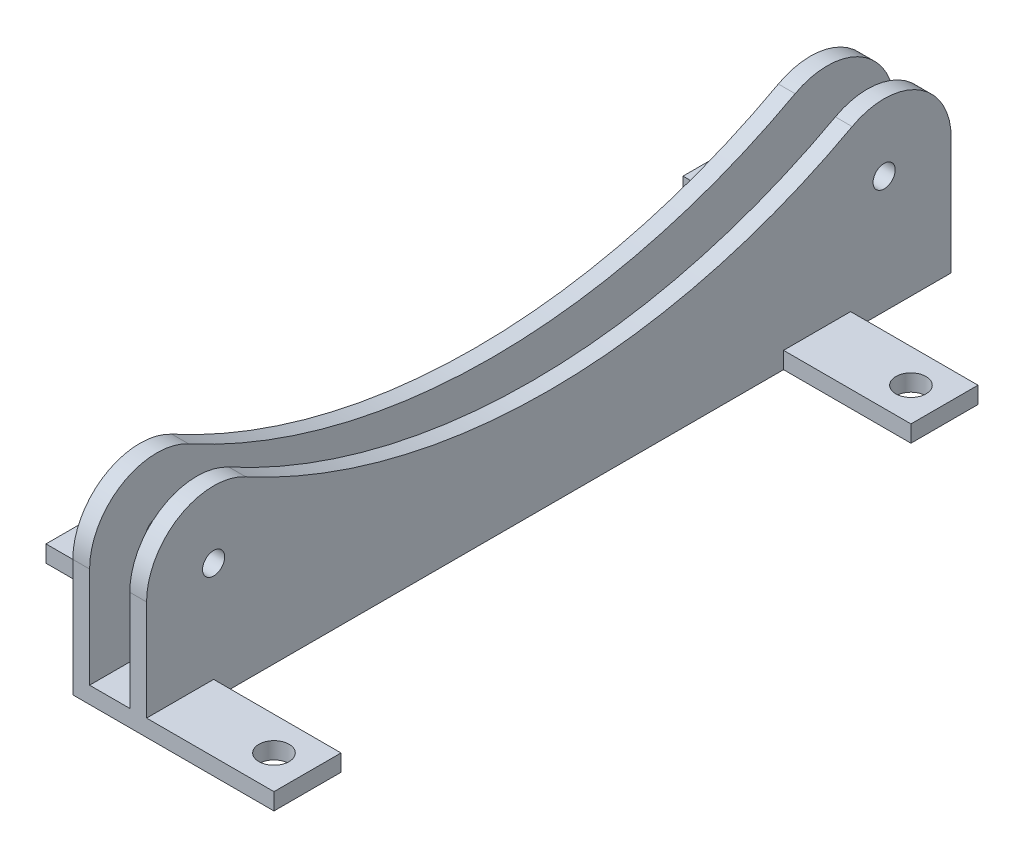
ISO-10303-21;
HEADER;
FILE_DESCRIPTION(('STEP AP214'),'2;1');
FILE_NAME('part.step','',(''),(''),'','','');
FILE_SCHEMA(('AUTOMOTIVE_DESIGN { 1 0 10303 214 1 1 1 1 }'));
ENDSEC;
DATA;
#1=APPLICATION_CONTEXT('core data for automotive mechanical design processes');
#2=APPLICATION_PROTOCOL_DEFINITION('international standard','automotive_design',2000,#1);
#3=PRODUCT_CONTEXT('',#1,'mechanical');
#4=PRODUCT('Part','Part','',(#3));
#5=PRODUCT_RELATED_PRODUCT_CATEGORY('part','',(#4));
#6=PRODUCT_DEFINITION_FORMATION('','',#4);
#7=PRODUCT_DEFINITION_CONTEXT('part definition',#1,'design');
#8=PRODUCT_DEFINITION('design','',#6,#7);
#9=PRODUCT_DEFINITION_SHAPE('','',#8);
#10=(LENGTH_UNIT() NAMED_UNIT(*) SI_UNIT(.MILLI.,.METRE.));
#11=(NAMED_UNIT(*) PLANE_ANGLE_UNIT() SI_UNIT($,.RADIAN.));
#12=(NAMED_UNIT(*) SI_UNIT($,.STERADIAN.) SOLID_ANGLE_UNIT());
#13=UNCERTAINTY_MEASURE_WITH_UNIT(LENGTH_MEASURE(1.E-05),#10,'distance_accuracy_value','');
#14=(GEOMETRIC_REPRESENTATION_CONTEXT(3) GLOBAL_UNCERTAINTY_ASSIGNED_CONTEXT((#13)) GLOBAL_UNIT_ASSIGNED_CONTEXT((#10,
#11,#12)) REPRESENTATION_CONTEXT('',''));
#15=CARTESIAN_POINT('',(0.,0.,0.));
#16=DIRECTION('',(0.,0.,1.));
#17=DIRECTION('',(1.,0.,0.));
#18=AXIS2_PLACEMENT_3D('',#15,#16,#17);
#19=CARTESIAN_POINT('',(0.,2.5,0.));
#20=DIRECTION('',(0.,-1.,0.));
#21=DIRECTION('',(0.,0.,-1.));
#22=AXIS2_PLACEMENT_3D('',#19,#20,#21);
#23=PLANE('',#22);
#24=DIRECTION('',(0.,0.,-1.));
#25=VECTOR('',#24,1.);
#26=CARTESIAN_POINT('',(2.5,2.5,0.));
#27=LINE('',#26,#25);
#28=CARTESIAN_POINT('',(2.5,2.5,-35.));
#29=VERTEX_POINT('',#28);
#30=CARTESIAN_POINT('',(2.5,2.5,-45.));
#31=VERTEX_POINT('',#30);
#32=EDGE_CURVE('E260',#29,#31,#27,.T.);
#33=ORIENTED_EDGE('',*,*,#32,.F.);
#34=DIRECTION('',(-1.,0.,0.));
#35=VECTOR('',#34,1.);
#36=CARTESIAN_POINT('',(-8.5,2.5,-35.));
#37=LINE('',#36,#35);
#38=CARTESIAN_POINT('',(21.5,2.5,-35.));
#39=VERTEX_POINT('',#38);
#40=EDGE_CURVE('E248',#39,#29,#37,.T.);
#41=ORIENTED_EDGE('',*,*,#40,.F.);
#42=DIRECTION('',(0.,0.,1.));
#43=VECTOR('',#42,1.);
#44=CARTESIAN_POINT('',(21.5,2.5,-35.));
#45=LINE('',#44,#43);
#46=CARTESIAN_POINT('',(21.5,2.5,-45.));
#47=VERTEX_POINT('',#46);
#48=EDGE_CURVE('E244',#47,#39,#45,.T.);
#49=ORIENTED_EDGE('',*,*,#48,.F.);
#50=DIRECTION('',(1.,0.,0.));
#51=VECTOR('',#50,1.);
#52=CARTESIAN_POINT('',(-8.5,2.5,-45.));
#53=LINE('',#52,#51);
#54=EDGE_CURVE('E242',#31,#47,#53,.T.);
#55=ORIENTED_EDGE('',*,*,#54,.F.);
#56=EDGE_LOOP('',(#33,#41,#49,#55));
#57=FACE_BOUND('',#56,.T.);
#58=CARTESIAN_POINT('',(16.5,2.5,-40.));
#59=DIRECTION('',(0.,1.,0.));
#60=DIRECTION('',(0.,0.,1.));
#61=AXIS2_PLACEMENT_3D('',#58,#59,#60);
#62=CIRCLE('',#61,2.25);
#63=CARTESIAN_POINT('',(16.5,2.5,-37.75));
#64=VERTEX_POINT('',#63);
#65=EDGE_CURVE('E899',#64,#64,#62,.T.);
#66=ORIENTED_EDGE('',*,*,#65,.F.);
#67=EDGE_LOOP('',(#66));
#68=FACE_BOUND('',#67,.T.);
#69=ADVANCED_FACE('F35',(#57,#68),#23,.F.);
#70=CARTESIAN_POINT('',(0.,0.,0.));
#71=DIRECTION('',(1.,0.,0.));
#72=DIRECTION('',(0.,0.,-1.));
#73=AXIS2_PLACEMENT_3D('',#70,#71,#72);
#74=PLANE('',#73);
#75=CARTESIAN_POINT('',(0.,17.5,-50.));
#76=DIRECTION('',(1.,0.,0.));
#77=DIRECTION('',(0.,0.,-1.));
#78=AXIS2_PLACEMENT_3D('',#75,#76,#77);
#79=CIRCLE('',#78,1.65);
#80=CARTESIAN_POINT('',(0.,17.5,-51.65));
#81=VERTEX_POINT('',#80);
#82=EDGE_CURVE('E315',#81,#81,#79,.T.);
#83=ORIENTED_EDGE('',*,*,#82,.T.);
#84=EDGE_LOOP('',(#83));
#85=FACE_BOUND('',#84,.T.);
#86=CARTESIAN_POINT('',(0.,17.5,50.));
#87=DIRECTION('',(1.,0.,0.));
#88=DIRECTION('',(0.,0.,-1.));
#89=AXIS2_PLACEMENT_3D('',#86,#87,#88);
#90=CIRCLE('',#89,1.65);
#91=CARTESIAN_POINT('',(0.,17.5,48.35));
#92=VERTEX_POINT('',#91);
#93=EDGE_CURVE('E325',#92,#92,#90,.T.);
#94=ORIENTED_EDGE('',*,*,#93,.T.);
#95=EDGE_LOOP('',(#94));
#96=FACE_BOUND('',#95,.T.);
#97=DIRECTION('',(0.,0.,-1.));
#98=VECTOR('',#97,1.);
#99=CARTESIAN_POINT('',(0.,2.5,-60.));
#100=LINE('',#99,#98);
#101=CARTESIAN_POINT('',(0.,2.5,60.));
#102=VERTEX_POINT('',#101);
#103=CARTESIAN_POINT('',(0.,2.5,-60.));
#104=VERTEX_POINT('',#103);
#105=EDGE_CURVE('E371',#102,#104,#100,.T.);
#106=ORIENTED_EDGE('',*,*,#105,.F.);
#107=DIRECTION('',(0.,1.,0.));
#108=VECTOR('',#107,1.);
#109=CARTESIAN_POINT('',(0.,0.,60.));
#110=LINE('',#109,#108);
#111=CARTESIAN_POINT('',(0.,17.5,60.));
#112=VERTEX_POINT('',#111);
#113=EDGE_CURVE('E400',#102,#112,#110,.T.);
#114=ORIENTED_EDGE('',*,*,#113,.T.);
#115=CARTESIAN_POINT('',(0.,17.5,50.));
#116=DIRECTION('',(1.,0.,0.));
#117=DIRECTION('',(0.,0.,-1.));
#118=AXIS2_PLACEMENT_3D('',#115,#116,#117);
#119=CIRCLE('',#118,10.);
#120=CARTESIAN_POINT('',(0.,26.2872576193619,45.2267303102625));
#121=VERTEX_POINT('',#120);
#122=EDGE_CURVE('E397',#121,#112,#119,.T.);
#123=ORIENTED_EDGE('',*,*,#122,.F.);
#124=CARTESIAN_POINT('',(0.,109.546523562816,0.));
#125=DIRECTION('',(1.,0.,0.));
#126=DIRECTION('',(0.,0.,-1.));
#127=AXIS2_PLACEMENT_3D('',#124,#125,#126);
#128=CIRCLE('',#127,94.75);
#129=CARTESIAN_POINT('',(0.,26.2872576193619,-45.2267303102625));
#130=VERTEX_POINT('',#129);
#131=EDGE_CURVE('E373',#121,#130,#128,.T.);
#132=ORIENTED_EDGE('',*,*,#131,.T.);
#133=CARTESIAN_POINT('',(0.,17.5,-50.));
#134=DIRECTION('',(1.,0.,0.));
#135=DIRECTION('',(0.,0.,-1.));
#136=AXIS2_PLACEMENT_3D('',#133,#134,#135);
#137=CIRCLE('',#136,10.);
#138=CARTESIAN_POINT('',(0.,17.5,-60.));
#139=VERTEX_POINT('',#138);
#140=EDGE_CURVE('E383',#139,#130,#137,.T.);
#141=ORIENTED_EDGE('',*,*,#140,.F.);
#142=DIRECTION('',(0.,-1.,0.));
#143=VECTOR('',#142,1.);
#144=CARTESIAN_POINT('',(0.,0.,-60.));
#145=LINE('',#144,#143);
#146=EDGE_CURVE('E402',#139,#104,#145,.T.);
#147=ORIENTED_EDGE('',*,*,#146,.T.);
#148=EDGE_LOOP('',(#106,#114,#123,#132,#141,#147));
#149=FACE_BOUND('',#148,.T.);
#150=ADVANCED_FACE('F463',(#85,#96,#149),#74,.F.);
#151=CARTESIAN_POINT('',(2.5,109.546523562816,0.));
#152=DIRECTION('',(-1.,0.,0.));
#153=DIRECTION('',(0.,0.,1.));
#154=AXIS2_PLACEMENT_3D('',#151,#152,#153);
#155=CYLINDRICAL_SURFACE('',#154,94.75);
#156=ORIENTED_EDGE('',*,*,#131,.F.);
#157=DIRECTION('',(-1.,0.,0.));
#158=VECTOR('',#157,1.);
#159=CARTESIAN_POINT('',(2.5,26.2872576193619,45.2267303102625));
#160=LINE('',#159,#158);
#161=CARTESIAN_POINT('',(2.5,26.2872576193619,45.2267303102625));
#162=VERTEX_POINT('',#161);
#163=EDGE_CURVE('E417',#162,#121,#160,.T.);
#164=ORIENTED_EDGE('',*,*,#163,.F.);
#165=CARTESIAN_POINT('',(2.5,109.546523562816,0.));
#166=DIRECTION('',(1.,0.,0.));
#167=DIRECTION('',(0.,0.,-1.));
#168=AXIS2_PLACEMENT_3D('',#165,#166,#167);
#169=CIRCLE('',#168,94.75);
#170=CARTESIAN_POINT('',(2.5,26.2872576193619,-45.2267303102625));
#171=VERTEX_POINT('',#170);
#172=EDGE_CURVE('E379',#162,#171,#169,.T.);
#173=ORIENTED_EDGE('',*,*,#172,.T.);
#174=DIRECTION('',(-1.,0.,0.));
#175=VECTOR('',#174,1.);
#176=CARTESIAN_POINT('',(2.5,26.2872576193619,-45.2267303102625));
#177=LINE('',#176,#175);
#178=EDGE_CURVE('E394',#171,#130,#177,.T.);
#179=ORIENTED_EDGE('',*,*,#178,.T.);
#180=EDGE_LOOP('',(#156,#164,#173,#179));
#181=FACE_BOUND('',#180,.T.);
#182=ADVANCED_FACE('F37',(#181),#155,.F.);
#183=CARTESIAN_POINT('',(2.5,17.5,50.));
#184=DIRECTION('',(-1.,0.,0.));
#185=DIRECTION('',(0.,0.,1.));
#186=AXIS2_PLACEMENT_3D('',#183,#184,#185);
#187=CYLINDRICAL_SURFACE('',#186,10.);
#188=ORIENTED_EDGE('',*,*,#122,.T.);
#189=DIRECTION('',(-1.,0.,0.));
#190=VECTOR('',#189,1.);
#191=CARTESIAN_POINT('',(2.5,17.5,60.));
#192=LINE('',#191,#190);
#193=CARTESIAN_POINT('',(2.5,17.5,60.));
#194=VERTEX_POINT('',#193);
#195=EDGE_CURVE('E414',#194,#112,#192,.T.);
#196=ORIENTED_EDGE('',*,*,#195,.F.);
#197=CARTESIAN_POINT('',(2.5,17.5,50.));
#198=DIRECTION('',(1.,0.,0.));
#199=DIRECTION('',(0.,0.,-1.));
#200=AXIS2_PLACEMENT_3D('',#197,#198,#199);
#201=CIRCLE('',#200,10.);
#202=EDGE_CURVE('E382',#162,#194,#201,.T.);
#203=ORIENTED_EDGE('',*,*,#202,.F.);
#204=ORIENTED_EDGE('',*,*,#163,.T.);
#205=EDGE_LOOP('',(#188,#196,#203,#204));
#206=FACE_BOUND('',#205,.T.);
#207=ADVANCED_FACE('F809',(#206),#187,.T.);
#208=CARTESIAN_POINT('',(2.5,0.,60.));
#209=DIRECTION('',(0.,0.,1.));
#210=DIRECTION('',(1.,0.,0.));
#211=AXIS2_PLACEMENT_3D('',#208,#209,#210);
#212=PLANE('',#211);
#213=DIRECTION('',(1.,0.,0.));
#214=VECTOR('',#213,1.);
#215=CARTESIAN_POINT('',(-500000.,2.5,60.));
#216=LINE('',#215,#214);
#217=CARTESIAN_POINT('',(-6.00000000008549,2.5,60.));
#218=VERTEX_POINT('',#217);
#219=EDGE_CURVE('E370',#218,#102,#216,.T.);
#220=ORIENTED_EDGE('',*,*,#219,.F.);
#221=DIRECTION('',(0.,1.,0.));
#222=VECTOR('',#221,1.);
#223=CARTESIAN_POINT('',(-6.,0.,60.));
#224=LINE('',#223,#222);
#225=CARTESIAN_POINT('',(-6.,17.5,60.));
#226=VERTEX_POINT('',#225);
#227=EDGE_CURVE('E353',#218,#226,#224,.T.);
#228=ORIENTED_EDGE('',*,*,#227,.T.);
#229=DIRECTION('',(1.,0.,0.));
#230=VECTOR('',#229,1.);
#231=CARTESIAN_POINT('',(-8.5,17.5,60.));
#232=LINE('',#231,#230);
#233=CARTESIAN_POINT('',(-8.5,17.5,60.));
#234=VERTEX_POINT('',#233);
#235=EDGE_CURVE('E365',#234,#226,#232,.T.);
#236=ORIENTED_EDGE('',*,*,#235,.F.);
#237=DIRECTION('',(0.,1.,0.));
#238=VECTOR('',#237,1.);
#239=CARTESIAN_POINT('',(-8.5,0.,60.));
#240=LINE('',#239,#238);
#241=CARTESIAN_POINT('',(-8.5,0.,60.));
#242=VERTEX_POINT('',#241);
#243=EDGE_CURVE('E336',#242,#234,#240,.T.);
#244=ORIENTED_EDGE('',*,*,#243,.F.);
#245=DIRECTION('',(-1.,0.,0.));
#246=VECTOR('',#245,1.);
#247=CARTESIAN_POINT('',(2.5,0.,60.));
#248=LINE('',#247,#246);
#249=CARTESIAN_POINT('',(21.5,0.,60.));
#250=VERTEX_POINT('',#249);
#251=EDGE_CURVE('E412',#250,#242,#248,.T.);
#252=ORIENTED_EDGE('',*,*,#251,.F.);
#253=DIRECTION('',(0.,-1.,0.));
#254=VECTOR('',#253,1.);
#255=CARTESIAN_POINT('',(21.5,2.5,60.));
#256=LINE('',#255,#254);
#257=CARTESIAN_POINT('',(21.5,2.5,60.));
#258=VERTEX_POINT('',#257);
#259=EDGE_CURVE('E225',#258,#250,#256,.T.);
#260=ORIENTED_EDGE('',*,*,#259,.F.);
#261=DIRECTION('',(-1.,0.,0.));
#262=VECTOR('',#261,1.);
#263=CARTESIAN_POINT('',(-8.5,2.5,60.));
#264=LINE('',#263,#262);
#265=CARTESIAN_POINT('',(2.5,2.5,60.));
#266=VERTEX_POINT('',#265);
#267=EDGE_CURVE('E226',#258,#266,#264,.T.);
#268=ORIENTED_EDGE('',*,*,#267,.T.);
#269=DIRECTION('',(0.,1.,0.));
#270=VECTOR('',#269,1.);
#271=CARTESIAN_POINT('',(2.5,0.,60.));
#272=LINE('',#271,#270);
#273=EDGE_CURVE('E55',#266,#194,#272,.T.);
#274=ORIENTED_EDGE('',*,*,#273,.T.);
#275=ORIENTED_EDGE('',*,*,#195,.T.);
#276=ORIENTED_EDGE('',*,*,#113,.F.);
#277=EDGE_LOOP('',(#220,#228,#236,#244,#252,#260,#268,#274,#275,#276));
#278=FACE_BOUND('',#277,.T.);
#279=ADVANCED_FACE('F504',(#278),#212,.T.);
#280=CARTESIAN_POINT('',(2.5,0.,0.));
#281=DIRECTION('',(0.,1.,0.));
#282=DIRECTION('',(0.,0.,1.));
#283=AXIS2_PLACEMENT_3D('',#280,#281,#282);
#284=PLANE('',#283);
#285=CARTESIAN_POINT('',(-22.5,0.,-55.));
#286=DIRECTION('',(0.,1.,0.));
#287=DIRECTION('',(0.,0.,1.));
#288=AXIS2_PLACEMENT_3D('',#285,#286,#287);
#289=CIRCLE('',#288,2.25);
#290=CARTESIAN_POINT('',(-22.5,0.,-52.75));
#291=VERTEX_POINT('',#290);
#292=EDGE_CURVE('E879',#291,#291,#289,.T.);
#293=ORIENTED_EDGE('',*,*,#292,.T.);
#294=EDGE_LOOP('',(#293));
#295=FACE_BOUND('',#294,.T.);
#296=CARTESIAN_POINT('',(16.5,0.,-40.));
#297=DIRECTION('',(0.,1.,0.));
#298=DIRECTION('',(0.,0.,1.));
#299=AXIS2_PLACEMENT_3D('',#296,#297,#298);
#300=CIRCLE('',#299,2.25);
#301=CARTESIAN_POINT('',(16.5,0.,-37.75));
#302=VERTEX_POINT('',#301);
#303=EDGE_CURVE('E883',#302,#302,#300,.T.);
#304=ORIENTED_EDGE('',*,*,#303,.T.);
#305=EDGE_LOOP('',(#304));
#306=FACE_BOUND('',#305,.T.);
#307=CARTESIAN_POINT('',(16.5,0.,55.));
#308=DIRECTION('',(0.,1.,0.));
#309=DIRECTION('',(0.,0.,1.));
#310=AXIS2_PLACEMENT_3D('',#307,#308,#309);
#311=CIRCLE('',#310,2.25);
#312=CARTESIAN_POINT('',(16.5,0.,57.25));
#313=VERTEX_POINT('',#312);
#314=EDGE_CURVE('E887',#313,#313,#311,.T.);
#315=ORIENTED_EDGE('',*,*,#314,.T.);
#316=EDGE_LOOP('',(#315));
#317=FACE_BOUND('',#316,.T.);
#318=CARTESIAN_POINT('',(-22.5,0.,40.));
#319=DIRECTION('',(0.,1.,0.));
#320=DIRECTION('',(0.,0.,1.));
#321=AXIS2_PLACEMENT_3D('',#318,#319,#320);
#322=CIRCLE('',#321,2.25);
#323=CARTESIAN_POINT('',(-22.5,0.,42.25));
#324=VERTEX_POINT('',#323);
#325=EDGE_CURVE('E236',#324,#324,#322,.T.);
#326=ORIENTED_EDGE('',*,*,#325,.T.);
#327=EDGE_LOOP('',(#326));
#328=FACE_BOUND('',#327,.T.);
#329=DIRECTION('',(0.,0.,-1.));
#330=VECTOR('',#329,1.);
#331=CARTESIAN_POINT('',(2.5,0.,0.));
#332=LINE('',#331,#330);
#333=CARTESIAN_POINT('',(2.5,0.,50.));
#334=VERTEX_POINT('',#333);
#335=CARTESIAN_POINT('',(2.5,0.,-35.));
#336=VERTEX_POINT('',#335);
#337=EDGE_CURVE('E387',#334,#336,#332,.T.);
#338=ORIENTED_EDGE('',*,*,#337,.F.);
#339=DIRECTION('',(1.,0.,0.));
#340=VECTOR('',#339,1.);
#341=CARTESIAN_POINT('',(-8.5,0.,50.));
#342=LINE('',#341,#340);
#343=CARTESIAN_POINT('',(21.5,0.,50.));
#344=VERTEX_POINT('',#343);
#345=EDGE_CURVE('E234',#334,#344,#342,.T.);
#346=ORIENTED_EDGE('',*,*,#345,.T.);
#347=DIRECTION('',(0.,0.,1.));
#348=VECTOR('',#347,1.);
#349=CARTESIAN_POINT('',(21.5,0.,60.));
#350=LINE('',#349,#348);
#351=EDGE_CURVE('E217',#344,#250,#350,.T.);
#352=ORIENTED_EDGE('',*,*,#351,.T.);
#353=ORIENTED_EDGE('',*,*,#251,.T.);
#354=DIRECTION('',(0.,0.,-1.));
#355=VECTOR('',#354,1.);
#356=CARTESIAN_POINT('',(-8.5,0.,0.));
#357=LINE('',#356,#355);
#358=CARTESIAN_POINT('',(-8.5,0.,45.));
#359=VERTEX_POINT('',#358);
#360=EDGE_CURVE('E339',#242,#359,#357,.T.);
#361=ORIENTED_EDGE('',*,*,#360,.T.);
#362=DIRECTION('',(-1.,0.,0.));
#363=VECTOR('',#362,1.);
#364=CARTESIAN_POINT('',(2.5,0.,45.));
#365=LINE('',#364,#363);
#366=CARTESIAN_POINT('',(-27.5,0.,45.));
#367=VERTEX_POINT('',#366);
#368=EDGE_CURVE('E287',#359,#367,#365,.T.);
#369=ORIENTED_EDGE('',*,*,#368,.T.);
#370=DIRECTION('',(0.,0.,-1.));
#371=VECTOR('',#370,1.);
#372=CARTESIAN_POINT('',(-27.5,0.,45.));
#373=LINE('',#372,#371);
#374=CARTESIAN_POINT('',(-27.5,0.,35.));
#375=VERTEX_POINT('',#374);
#376=EDGE_CURVE('E301',#367,#375,#373,.T.);
#377=ORIENTED_EDGE('',*,*,#376,.T.);
#378=DIRECTION('',(1.,0.,0.));
#379=VECTOR('',#378,1.);
#380=CARTESIAN_POINT('',(2.5,0.,35.));
#381=LINE('',#380,#379);
#382=CARTESIAN_POINT('',(-8.5,0.,35.));
#383=VERTEX_POINT('',#382);
#384=EDGE_CURVE('E293',#375,#383,#381,.T.);
#385=ORIENTED_EDGE('',*,*,#384,.T.);
#386=CARTESIAN_POINT('',(-8.5,0.,-50.));
#387=VERTEX_POINT('',#386);
#388=EDGE_CURVE('E338',#383,#387,#357,.T.);
#389=ORIENTED_EDGE('',*,*,#388,.T.);
#390=DIRECTION('',(-1.,0.,0.));
#391=VECTOR('',#390,1.);
#392=CARTESIAN_POINT('',(2.49999999999999,0.,-50.));
#393=LINE('',#392,#391);
#394=CARTESIAN_POINT('',(-27.5,0.,-50.));
#395=VERTEX_POINT('',#394);
#396=EDGE_CURVE('E270',#387,#395,#393,.T.);
#397=ORIENTED_EDGE('',*,*,#396,.T.);
#398=DIRECTION('',(0.,0.,-1.));
#399=VECTOR('',#398,1.);
#400=CARTESIAN_POINT('',(-27.5,0.,-60.));
#401=LINE('',#400,#399);
#402=CARTESIAN_POINT('',(-27.5,0.,-60.));
#403=VERTEX_POINT('',#402);
#404=EDGE_CURVE('E274',#395,#403,#401,.T.);
#405=ORIENTED_EDGE('',*,*,#404,.T.);
#406=DIRECTION('',(-1.,0.,0.));
#407=VECTOR('',#406,1.);
#408=CARTESIAN_POINT('',(2.5,0.,-60.));
#409=LINE('',#408,#407);
#410=CARTESIAN_POINT('',(2.5,0.,-60.));
#411=VERTEX_POINT('',#410);
#412=EDGE_CURVE('E410',#411,#403,#409,.T.);
#413=ORIENTED_EDGE('',*,*,#412,.F.);
#414=CARTESIAN_POINT('',(2.5,0.,-45.));
#415=VERTEX_POINT('',#414);
#416=EDGE_CURVE('E386',#415,#411,#332,.T.);
#417=ORIENTED_EDGE('',*,*,#416,.F.);
#418=DIRECTION('',(1.,0.,0.));
#419=VECTOR('',#418,1.);
#420=CARTESIAN_POINT('',(-8.5,0.,-45.));
#421=LINE('',#420,#419);
#422=CARTESIAN_POINT('',(21.5,0.,-45.));
#423=VERTEX_POINT('',#422);
#424=EDGE_CURVE('E241',#415,#423,#421,.T.);
#425=ORIENTED_EDGE('',*,*,#424,.T.);
#426=DIRECTION('',(0.,0.,1.));
#427=VECTOR('',#426,1.);
#428=CARTESIAN_POINT('',(21.5,0.,-35.));
#429=LINE('',#428,#427);
#430=CARTESIAN_POINT('',(21.5,0.,-35.));
#431=VERTEX_POINT('',#430);
#432=EDGE_CURVE('E253',#423,#431,#429,.T.);
#433=ORIENTED_EDGE('',*,*,#432,.T.);
#434=DIRECTION('',(-1.,0.,0.));
#435=VECTOR('',#434,1.);
#436=CARTESIAN_POINT('',(-8.5,0.,-35.));
#437=LINE('',#436,#435);
#438=EDGE_CURVE('E245',#431,#336,#437,.T.);
#439=ORIENTED_EDGE('',*,*,#438,.T.);
#440=EDGE_LOOP('',(#338,#346,#352,#353,#361,#369,#377,#385,#389,#397,#405,#413,#417,#425,#433,#439));
#441=FACE_BOUND('',#440,.T.);
#442=ADVANCED_FACE('F477',(#295,#306,#317,#328,#441),#284,.F.);
#443=CARTESIAN_POINT('',(2.5,0.,-60.));
#444=DIRECTION('',(0.,0.,-1.));
#445=DIRECTION('',(-1.,0.,0.));
#446=AXIS2_PLACEMENT_3D('',#443,#444,#445);
#447=PLANE('',#446);
#448=DIRECTION('',(1.,0.,0.));
#449=VECTOR('',#448,1.);
#450=CARTESIAN_POINT('',(-500000.,2.5,-60.));
#451=LINE('',#450,#449);
#452=CARTESIAN_POINT('',(-6.,2.5,-60.));
#453=VERTEX_POINT('',#452);
#454=EDGE_CURVE('E374',#453,#104,#451,.T.);
#455=ORIENTED_EDGE('',*,*,#454,.T.);
#456=ORIENTED_EDGE('',*,*,#146,.F.);
#457=DIRECTION('',(-1.,0.,0.));
#458=VECTOR('',#457,1.);
#459=CARTESIAN_POINT('',(2.5,17.5,-60.));
#460=LINE('',#459,#458);
#461=CARTESIAN_POINT('',(2.5,17.5,-60.));
#462=VERTEX_POINT('',#461);
#463=EDGE_CURVE('E408',#462,#139,#460,.T.);
#464=ORIENTED_EDGE('',*,*,#463,.F.);
#465=DIRECTION('',(0.,-1.,0.));
#466=VECTOR('',#465,1.);
#467=CARTESIAN_POINT('',(2.5,0.,-60.));
#468=LINE('',#467,#466);
#469=EDGE_CURVE('E389',#462,#411,#468,.T.);
#470=ORIENTED_EDGE('',*,*,#469,.T.);
#471=ORIENTED_EDGE('',*,*,#412,.T.);
#472=DIRECTION('',(0.,-1.,0.));
#473=VECTOR('',#472,1.);
#474=CARTESIAN_POINT('',(-27.5,2.5,-60.));
#475=LINE('',#474,#473);
#476=CARTESIAN_POINT('',(-27.5,2.5,-60.));
#477=VERTEX_POINT('',#476);
#478=EDGE_CURVE('E284',#477,#403,#475,.T.);
#479=ORIENTED_EDGE('',*,*,#478,.F.);
#480=DIRECTION('',(1.,0.,0.));
#481=VECTOR('',#480,1.);
#482=CARTESIAN_POINT('',(2.5,2.5,-60.));
#483=LINE('',#482,#481);
#484=CARTESIAN_POINT('',(-8.5,2.5,-60.));
#485=VERTEX_POINT('',#484);
#486=EDGE_CURVE('E277',#477,#485,#483,.T.);
#487=ORIENTED_EDGE('',*,*,#486,.T.);
#488=DIRECTION('',(0.,-1.,0.));
#489=VECTOR('',#488,1.);
#490=CARTESIAN_POINT('',(-8.5,0.,-60.));
#491=LINE('',#490,#489);
#492=CARTESIAN_POINT('',(-8.5,17.5,-60.));
#493=VERTEX_POINT('',#492);
#494=EDGE_CURVE('E341',#493,#485,#491,.T.);
#495=ORIENTED_EDGE('',*,*,#494,.F.);
#496=DIRECTION('',(1.,0.,0.));
#497=VECTOR('',#496,1.);
#498=CARTESIAN_POINT('',(-8.5,17.5,-60.));
#499=LINE('',#498,#497);
#500=CARTESIAN_POINT('',(-6.,17.5,-60.));
#501=VERTEX_POINT('',#500);
#502=EDGE_CURVE('E363',#493,#501,#499,.T.);
#503=ORIENTED_EDGE('',*,*,#502,.T.);
#504=DIRECTION('',(0.,-1.,0.));
#505=VECTOR('',#504,1.);
#506=CARTESIAN_POINT('',(-6.,0.,-60.));
#507=LINE('',#506,#505);
#508=EDGE_CURVE('E355',#501,#453,#507,.T.);
#509=ORIENTED_EDGE('',*,*,#508,.T.);
#510=EDGE_LOOP('',(#455,#456,#464,#470,#471,#479,#487,#495,#503,#509));
#511=FACE_BOUND('',#510,.T.);
#512=ADVANCED_FACE('F440',(#511),#447,.T.);
#513=CARTESIAN_POINT('',(2.5,17.5,-50.));
#514=DIRECTION('',(-1.,0.,0.));
#515=DIRECTION('',(0.,0.,1.));
#516=AXIS2_PLACEMENT_3D('',#513,#514,#515);
#517=CYLINDRICAL_SURFACE('',#516,10.);
#518=ORIENTED_EDGE('',*,*,#140,.T.);
#519=ORIENTED_EDGE('',*,*,#178,.F.);
#520=CARTESIAN_POINT('',(2.5,17.5,-50.));
#521=DIRECTION('',(1.,0.,0.));
#522=DIRECTION('',(0.,0.,-1.));
#523=AXIS2_PLACEMENT_3D('',#520,#521,#522);
#524=CIRCLE('',#523,10.);
#525=EDGE_CURVE('E392',#462,#171,#524,.T.);
#526=ORIENTED_EDGE('',*,*,#525,.F.);
#527=ORIENTED_EDGE('',*,*,#463,.T.);
#528=EDGE_LOOP('',(#518,#519,#526,#527));
#529=FACE_BOUND('',#528,.T.);
#530=ADVANCED_FACE('F469',(#529),#517,.T.);
#531=CARTESIAN_POINT('',(2.5,0.,0.));
#532=DIRECTION('',(1.,0.,0.));
#533=DIRECTION('',(0.,0.,-1.));
#534=AXIS2_PLACEMENT_3D('',#531,#532,#533);
#535=PLANE('',#534);
#536=DIRECTION('',(0.,1.,0.));
#537=VECTOR('',#536,1.);
#538=CARTESIAN_POINT('',(2.5,0.,50.));
#539=LINE('',#538,#537);
#540=CARTESIAN_POINT('',(2.5,2.5,50.));
#541=VERTEX_POINT('',#540);
#542=EDGE_CURVE('E213',#334,#541,#539,.T.);
#543=ORIENTED_EDGE('',*,*,#542,.F.);
#544=ORIENTED_EDGE('',*,*,#337,.T.);
#545=DIRECTION('',(0.,-1.,0.));
#546=VECTOR('',#545,1.);
#547=CARTESIAN_POINT('',(2.5,0.,-35.));
#548=LINE('',#547,#546);
#549=EDGE_CURVE('E267',#29,#336,#548,.T.);
#550=ORIENTED_EDGE('',*,*,#549,.F.);
#551=ORIENTED_EDGE('',*,*,#32,.T.);
#552=DIRECTION('',(0.,1.,0.));
#553=VECTOR('',#552,1.);
#554=CARTESIAN_POINT('',(2.5,0.,-45.));
#555=LINE('',#554,#553);
#556=EDGE_CURVE('E264',#415,#31,#555,.T.);
#557=ORIENTED_EDGE('',*,*,#556,.F.);
#558=ORIENTED_EDGE('',*,*,#416,.T.);
#559=ORIENTED_EDGE('',*,*,#469,.F.);
#560=ORIENTED_EDGE('',*,*,#525,.T.);
#561=ORIENTED_EDGE('',*,*,#172,.F.);
#562=ORIENTED_EDGE('',*,*,#202,.T.);
#563=ORIENTED_EDGE('',*,*,#273,.F.);
#564=DIRECTION('',(0.,0.,-1.));
#565=VECTOR('',#564,1.);
#566=CARTESIAN_POINT('',(2.5,2.5,0.));
#567=LINE('',#566,#565);
#568=EDGE_CURVE('E50',#266,#541,#567,.T.);
#569=ORIENTED_EDGE('',*,*,#568,.T.);
#570=EDGE_LOOP('',(#543,#544,#550,#551,#557,#558,#559,#560,#561,#562,#563,#569));
#571=FACE_BOUND('',#570,.T.);
#572=CARTESIAN_POINT('',(2.5,17.5,-50.));
#573=DIRECTION('',(1.,0.,0.));
#574=DIRECTION('',(0.,0.,-1.));
#575=AXIS2_PLACEMENT_3D('',#572,#573,#574);
#576=CIRCLE('',#575,1.65);
#577=CARTESIAN_POINT('',(2.5,17.5,-51.65));
#578=VERTEX_POINT('',#577);
#579=EDGE_CURVE('E307',#578,#578,#576,.T.);
#580=ORIENTED_EDGE('',*,*,#579,.F.);
#581=EDGE_LOOP('',(#580));
#582=FACE_BOUND('',#581,.T.);
#583=CARTESIAN_POINT('',(2.5,17.5,50.));
#584=DIRECTION('',(1.,0.,0.));
#585=DIRECTION('',(0.,0.,-1.));
#586=AXIS2_PLACEMENT_3D('',#583,#584,#585);
#587=CIRCLE('',#586,1.65);
#588=CARTESIAN_POINT('',(2.5,17.5,48.35));
#589=VERTEX_POINT('',#588);
#590=EDGE_CURVE('E319',#589,#589,#587,.T.);
#591=ORIENTED_EDGE('',*,*,#590,.F.);
#592=EDGE_LOOP('',(#591));
#593=FACE_BOUND('',#592,.T.);
#594=ADVANCED_FACE('F472',(#571,#582,#593),#535,.T.);
#595=CARTESIAN_POINT('',(-500000.,2.5,-60.));
#596=DIRECTION('',(0.,-1.,0.));
#597=DIRECTION('',(0.,0.,-1.));
#598=AXIS2_PLACEMENT_3D('',#595,#596,#597);
#599=PLANE('',#598);
#600=DIRECTION('',(0.,0.,1.));
#601=VECTOR('',#600,1.);
#602=CARTESIAN_POINT('',(-5.99999999997181,2.5,-60.));
#603=LINE('',#602,#601);
#604=EDGE_CURVE('E362',#453,#218,#603,.T.);
#605=ORIENTED_EDGE('',*,*,#604,.T.);
#606=ORIENTED_EDGE('',*,*,#219,.T.);
#607=ORIENTED_EDGE('',*,*,#105,.T.);
#608=ORIENTED_EDGE('',*,*,#454,.F.);
#609=EDGE_LOOP('',(#605,#606,#607,#608));
#610=FACE_BOUND('',#609,.T.);
#611=ADVANCED_FACE('F458',(#610),#599,.F.);
#612=CARTESIAN_POINT('',(-6.,0.,0.));
#613=DIRECTION('',(1.,0.,0.));
#614=DIRECTION('',(0.,0.,-1.));
#615=AXIS2_PLACEMENT_3D('',#612,#613,#614);
#616=PLANE('',#615);
#617=CARTESIAN_POINT('',(-6.,17.5,-50.));
#618=DIRECTION('',(1.,0.,0.));
#619=DIRECTION('',(0.,0.,-1.));
#620=AXIS2_PLACEMENT_3D('',#617,#618,#619);
#621=CIRCLE('',#620,1.65);
#622=CARTESIAN_POINT('',(-6.,17.5,-51.65));
#623=VERTEX_POINT('',#622);
#624=EDGE_CURVE('E316',#623,#623,#621,.T.);
#625=ORIENTED_EDGE('',*,*,#624,.F.);
#626=EDGE_LOOP('',(#625));
#627=FACE_BOUND('',#626,.T.);
#628=CARTESIAN_POINT('',(-6.,17.5,50.));
#629=DIRECTION('',(1.,0.,0.));
#630=DIRECTION('',(0.,0.,-1.));
#631=AXIS2_PLACEMENT_3D('',#628,#629,#630);
#632=CIRCLE('',#631,1.65);
#633=CARTESIAN_POINT('',(-6.,17.5,48.35));
#634=VERTEX_POINT('',#633);
#635=EDGE_CURVE('E326',#634,#634,#632,.T.);
#636=ORIENTED_EDGE('',*,*,#635,.F.);
#637=EDGE_LOOP('',(#636));
#638=FACE_BOUND('',#637,.T.);
#639=ORIENTED_EDGE('',*,*,#604,.F.);
#640=ORIENTED_EDGE('',*,*,#508,.F.);
#641=CARTESIAN_POINT('',(-6.,17.5,-50.));
#642=DIRECTION('',(1.,0.,0.));
#643=DIRECTION('',(0.,0.,-1.));
#644=AXIS2_PLACEMENT_3D('',#641,#642,#643);
#645=CIRCLE('',#644,10.);
#646=CARTESIAN_POINT('',(-6.,26.2872576193619,-45.2267303102625));
#647=VERTEX_POINT('',#646);
#648=EDGE_CURVE('E333',#501,#647,#645,.T.);
#649=ORIENTED_EDGE('',*,*,#648,.T.);
#650=CARTESIAN_POINT('',(-6.,109.546523562816,0.));
#651=DIRECTION('',(1.,0.,0.));
#652=DIRECTION('',(0.,0.,-1.));
#653=AXIS2_PLACEMENT_3D('',#650,#651,#652);
#654=CIRCLE('',#653,94.75);
#655=CARTESIAN_POINT('',(-6.,26.2872576193619,45.2267303102625));
#656=VERTEX_POINT('',#655);
#657=EDGE_CURVE('E329',#656,#647,#654,.T.);
#658=ORIENTED_EDGE('',*,*,#657,.F.);
#659=CARTESIAN_POINT('',(-6.,17.5,50.));
#660=DIRECTION('',(1.,0.,0.));
#661=DIRECTION('',(0.,0.,-1.));
#662=AXIS2_PLACEMENT_3D('',#659,#660,#661);
#663=CIRCLE('',#662,10.);
#664=EDGE_CURVE('E350',#656,#226,#663,.T.);
#665=ORIENTED_EDGE('',*,*,#664,.T.);
#666=ORIENTED_EDGE('',*,*,#227,.F.);
#667=EDGE_LOOP('',(#639,#640,#649,#658,#665,#666));
#668=FACE_BOUND('',#667,.T.);
#669=ADVANCED_FACE('F453',(#627,#638,#668),#616,.T.);
#670=CARTESIAN_POINT('',(-8.5,109.546523562816,0.));
#671=DIRECTION('',(1.,0.,0.));
#672=DIRECTION('',(0.,0.,-1.));
#673=AXIS2_PLACEMENT_3D('',#670,#671,#672);
#674=CYLINDRICAL_SURFACE('',#673,94.75);
#675=ORIENTED_EDGE('',*,*,#657,.T.);
#676=DIRECTION('',(1.,0.,0.));
#677=VECTOR('',#676,1.);
#678=CARTESIAN_POINT('',(-8.5,26.2872576193619,-45.2267303102625));
#679=LINE('',#678,#677);
#680=CARTESIAN_POINT('',(-8.5,26.2872576193619,-45.2267303102625));
#681=VERTEX_POINT('',#680);
#682=EDGE_CURVE('E360',#681,#647,#679,.T.);
#683=ORIENTED_EDGE('',*,*,#682,.F.);
#684=CARTESIAN_POINT('',(-8.5,109.546523562816,0.));
#685=DIRECTION('',(1.,0.,0.));
#686=DIRECTION('',(0.,0.,-1.));
#687=AXIS2_PLACEMENT_3D('',#684,#685,#686);
#688=CIRCLE('',#687,94.75);
#689=CARTESIAN_POINT('',(-8.5,26.2872576193619,45.2267303102625));
#690=VERTEX_POINT('',#689);
#691=EDGE_CURVE('E330',#690,#681,#688,.T.);
#692=ORIENTED_EDGE('',*,*,#691,.F.);
#693=DIRECTION('',(1.,0.,0.));
#694=VECTOR('',#693,1.);
#695=CARTESIAN_POINT('',(-8.5,26.2872576193619,45.2267303102625));
#696=LINE('',#695,#694);
#697=EDGE_CURVE('E347',#690,#656,#696,.T.);
#698=ORIENTED_EDGE('',*,*,#697,.T.);
#699=EDGE_LOOP('',(#675,#683,#692,#698));
#700=FACE_BOUND('',#699,.T.);
#701=ADVANCED_FACE('F509',(#700),#674,.F.);
#702=CARTESIAN_POINT('',(-8.5,17.5,-50.));
#703=DIRECTION('',(1.,0.,0.));
#704=DIRECTION('',(0.,0.,-1.));
#705=AXIS2_PLACEMENT_3D('',#702,#703,#704);
#706=CYLINDRICAL_SURFACE('',#705,10.);
#707=ORIENTED_EDGE('',*,*,#648,.F.);
#708=ORIENTED_EDGE('',*,*,#502,.F.);
#709=CARTESIAN_POINT('',(-8.5,17.5,-50.));
#710=DIRECTION('',(1.,0.,0.));
#711=DIRECTION('',(0.,0.,-1.));
#712=AXIS2_PLACEMENT_3D('',#709,#710,#711);
#713=CIRCLE('',#712,10.);
#714=EDGE_CURVE('E344',#493,#681,#713,.T.);
#715=ORIENTED_EDGE('',*,*,#714,.T.);
#716=ORIENTED_EDGE('',*,*,#682,.T.);
#717=EDGE_LOOP('',(#707,#708,#715,#716));
#718=FACE_BOUND('',#717,.T.);
#719=ADVANCED_FACE('F449',(#718),#706,.T.);
#720=CARTESIAN_POINT('',(-8.5,17.5,50.));
#721=DIRECTION('',(1.,0.,0.));
#722=DIRECTION('',(0.,0.,-1.));
#723=AXIS2_PLACEMENT_3D('',#720,#721,#722);
#724=CYLINDRICAL_SURFACE('',#723,10.);
#725=ORIENTED_EDGE('',*,*,#664,.F.);
#726=ORIENTED_EDGE('',*,*,#697,.F.);
#727=CARTESIAN_POINT('',(-8.5,17.5,50.));
#728=DIRECTION('',(1.,0.,0.));
#729=DIRECTION('',(0.,0.,-1.));
#730=AXIS2_PLACEMENT_3D('',#727,#728,#729);
#731=CIRCLE('',#730,10.);
#732=EDGE_CURVE('E332',#690,#234,#731,.T.);
#733=ORIENTED_EDGE('',*,*,#732,.T.);
#734=ORIENTED_EDGE('',*,*,#235,.T.);
#735=EDGE_LOOP('',(#725,#726,#733,#734));
#736=FACE_BOUND('',#735,.T.);
#737=ADVANCED_FACE('F507',(#736),#724,.T.);
#738=CARTESIAN_POINT('',(-8.5,0.,0.));
#739=DIRECTION('',(1.,0.,0.));
#740=DIRECTION('',(0.,0.,-1.));
#741=AXIS2_PLACEMENT_3D('',#738,#739,#740);
#742=PLANE('',#741);
#743=DIRECTION('',(0.,-1.,0.));
#744=VECTOR('',#743,1.);
#745=CARTESIAN_POINT('',(-8.5,0.,45.));
#746=LINE('',#745,#744);
#747=CARTESIAN_POINT('',(-8.5,2.5,45.));
#748=VERTEX_POINT('',#747);
#749=EDGE_CURVE('E426',#748,#359,#746,.T.);
#750=ORIENTED_EDGE('',*,*,#749,.T.);
#751=ORIENTED_EDGE('',*,*,#360,.F.);
#752=ORIENTED_EDGE('',*,*,#243,.T.);
#753=ORIENTED_EDGE('',*,*,#732,.F.);
#754=ORIENTED_EDGE('',*,*,#691,.T.);
#755=ORIENTED_EDGE('',*,*,#714,.F.);
#756=ORIENTED_EDGE('',*,*,#494,.T.);
#757=DIRECTION('',(0.,0.,-1.));
#758=VECTOR('',#757,1.);
#759=CARTESIAN_POINT('',(-8.5,2.5,0.));
#760=LINE('',#759,#758);
#761=CARTESIAN_POINT('',(-8.5,2.5,-50.));
#762=VERTEX_POINT('',#761);
#763=EDGE_CURVE('E43',#762,#485,#760,.T.);
#764=ORIENTED_EDGE('',*,*,#763,.F.);
#765=DIRECTION('',(0.,-1.,0.));
#766=VECTOR('',#765,1.);
#767=CARTESIAN_POINT('',(-8.5,0.,-50.));
#768=LINE('',#767,#766);
#769=EDGE_CURVE('E11',#762,#387,#768,.T.);
#770=ORIENTED_EDGE('',*,*,#769,.T.);
#771=ORIENTED_EDGE('',*,*,#388,.F.);
#772=DIRECTION('',(0.,1.,0.));
#773=VECTOR('',#772,1.);
#774=CARTESIAN_POINT('',(-8.5,0.,35.));
#775=LINE('',#774,#773);
#776=CARTESIAN_POINT('',(-8.5,2.5,35.));
#777=VERTEX_POINT('',#776);
#778=EDGE_CURVE('E429',#383,#777,#775,.T.);
#779=ORIENTED_EDGE('',*,*,#778,.T.);
#780=DIRECTION('',(0.,0.,1.));
#781=VECTOR('',#780,1.);
#782=CARTESIAN_POINT('',(-8.5,2.5,0.));
#783=LINE('',#782,#781);
#784=EDGE_CURVE('E419',#777,#748,#783,.T.);
#785=ORIENTED_EDGE('',*,*,#784,.T.);
#786=EDGE_LOOP('',(#750,#751,#752,#753,#754,#755,#756,#764,#770,#771,#779,#785));
#787=FACE_BOUND('',#786,.T.);
#788=CARTESIAN_POINT('',(-8.5,17.5,-50.));
#789=DIRECTION('',(1.,0.,0.));
#790=DIRECTION('',(0.,0.,-1.));
#791=AXIS2_PLACEMENT_3D('',#788,#789,#790);
#792=CIRCLE('',#791,1.65);
#793=CARTESIAN_POINT('',(-8.5,17.5,-51.65));
#794=VERTEX_POINT('',#793);
#795=EDGE_CURVE('E312',#794,#794,#792,.T.);
#796=ORIENTED_EDGE('',*,*,#795,.T.);
#797=EDGE_LOOP('',(#796));
#798=FACE_BOUND('',#797,.T.);
#799=CARTESIAN_POINT('',(-8.5,17.5,50.));
#800=DIRECTION('',(1.,0.,0.));
#801=DIRECTION('',(0.,0.,-1.));
#802=AXIS2_PLACEMENT_3D('',#799,#800,#801);
#803=CIRCLE('',#802,1.65);
#804=CARTESIAN_POINT('',(-8.5,17.5,48.35));
#805=VERTEX_POINT('',#804);
#806=EDGE_CURVE('E322',#805,#805,#803,.T.);
#807=ORIENTED_EDGE('',*,*,#806,.T.);
#808=EDGE_LOOP('',(#807));
#809=FACE_BOUND('',#808,.T.);
#810=ADVANCED_FACE('F442',(#787,#798,#809),#742,.F.);
#811=CARTESIAN_POINT('',(2.5,17.5,50.));
#812=DIRECTION('',(1.,0.,0.));
#813=DIRECTION('',(0.,0.,-1.));
#814=AXIS2_PLACEMENT_3D('',#811,#812,#813);
#815=CYLINDRICAL_SURFACE('',#814,1.65);
#816=ORIENTED_EDGE('',*,*,#590,.T.);
#817=EDGE_LOOP('',(#816));
#818=FACE_BOUND('',#817,.T.);
#819=ORIENTED_EDGE('',*,*,#93,.F.);
#820=EDGE_LOOP('',(#819));
#821=FACE_BOUND('',#820,.T.);
#822=ADVANCED_FACE('F572',(#818,#821),#815,.F.);
#823=ORIENTED_EDGE('',*,*,#635,.T.);
#824=EDGE_LOOP('',(#823));
#825=FACE_BOUND('',#824,.T.);
#826=ORIENTED_EDGE('',*,*,#806,.F.);
#827=EDGE_LOOP('',(#826));
#828=FACE_BOUND('',#827,.T.);
#829=ADVANCED_FACE('F569',(#825,#828),#815,.F.);
#830=CARTESIAN_POINT('',(2.5,17.5,-50.));
#831=DIRECTION('',(1.,0.,0.));
#832=DIRECTION('',(0.,0.,-1.));
#833=AXIS2_PLACEMENT_3D('',#830,#831,#832);
#834=CYLINDRICAL_SURFACE('',#833,1.65);
#835=ORIENTED_EDGE('',*,*,#579,.T.);
#836=EDGE_LOOP('',(#835));
#837=FACE_BOUND('',#836,.T.);
#838=ORIENTED_EDGE('',*,*,#82,.F.);
#839=EDGE_LOOP('',(#838));
#840=FACE_BOUND('',#839,.T.);
#841=ADVANCED_FACE('F567',(#837,#840),#834,.F.);
#842=ORIENTED_EDGE('',*,*,#624,.T.);
#843=EDGE_LOOP('',(#842));
#844=FACE_BOUND('',#843,.T.);
#845=ORIENTED_EDGE('',*,*,#795,.F.);
#846=EDGE_LOOP('',(#845));
#847=FACE_BOUND('',#846,.T.);
#848=ADVANCED_FACE('F559',(#844,#847),#834,.F.);
#849=CARTESIAN_POINT('',(2.5,2.5,35.));
#850=DIRECTION('',(0.,0.,-1.));
#851=DIRECTION('',(-1.,0.,0.));
#852=AXIS2_PLACEMENT_3D('',#849,#850,#851);
#853=PLANE('',#852);
#854=ORIENTED_EDGE('',*,*,#778,.F.);
#855=ORIENTED_EDGE('',*,*,#384,.F.);
#856=DIRECTION('',(0.,-1.,0.));
#857=VECTOR('',#856,1.);
#858=CARTESIAN_POINT('',(-27.5,2.5,35.));
#859=LINE('',#858,#857);
#860=CARTESIAN_POINT('',(-27.5,2.5,35.));
#861=VERTEX_POINT('',#860);
#862=EDGE_CURVE('E305',#861,#375,#859,.T.);
#863=ORIENTED_EDGE('',*,*,#862,.F.);
#864=DIRECTION('',(1.,0.,0.));
#865=VECTOR('',#864,1.);
#866=CARTESIAN_POINT('',(2.5,2.5,35.));
#867=LINE('',#866,#865);
#868=EDGE_CURVE('E296',#861,#777,#867,.T.);
#869=ORIENTED_EDGE('',*,*,#868,.T.);
#870=EDGE_LOOP('',(#854,#855,#863,#869));
#871=FACE_BOUND('',#870,.T.);
#872=ADVANCED_FACE('F490',(#871),#853,.T.);
#873=CARTESIAN_POINT('',(2.5,2.5,45.));
#874=DIRECTION('',(0.,0.,1.));
#875=DIRECTION('',(1.,0.,0.));
#876=AXIS2_PLACEMENT_3D('',#873,#874,#875);
#877=PLANE('',#876);
#878=ORIENTED_EDGE('',*,*,#749,.F.);
#879=DIRECTION('',(-1.,0.,0.));
#880=VECTOR('',#879,1.);
#881=CARTESIAN_POINT('',(2.5,2.5,45.));
#882=LINE('',#881,#880);
#883=CARTESIAN_POINT('',(-27.5,2.5,45.));
#884=VERTEX_POINT('',#883);
#885=EDGE_CURVE('E290',#748,#884,#882,.T.);
#886=ORIENTED_EDGE('',*,*,#885,.T.);
#887=DIRECTION('',(0.,-1.,0.));
#888=VECTOR('',#887,1.);
#889=CARTESIAN_POINT('',(-27.5,2.5,45.));
#890=LINE('',#889,#888);
#891=EDGE_CURVE('E299',#884,#367,#890,.T.);
#892=ORIENTED_EDGE('',*,*,#891,.T.);
#893=ORIENTED_EDGE('',*,*,#368,.F.);
#894=EDGE_LOOP('',(#878,#886,#892,#893));
#895=FACE_BOUND('',#894,.T.);
#896=ADVANCED_FACE('F499',(#895),#877,.T.);
#897=CARTESIAN_POINT('',(0.,2.5,0.));
#898=DIRECTION('',(0.,1.,0.));
#899=DIRECTION('',(0.,0.,1.));
#900=AXIS2_PLACEMENT_3D('',#897,#898,#899);
#901=PLANE('',#900);
#902=CARTESIAN_POINT('',(-22.5,2.5,40.));
#903=DIRECTION('',(0.,1.,0.));
#904=DIRECTION('',(0.,0.,1.));
#905=AXIS2_PLACEMENT_3D('',#902,#903,#904);
#906=CIRCLE('',#905,2.25);
#907=CARTESIAN_POINT('',(-22.5,2.5,42.25));
#908=VERTEX_POINT('',#907);
#909=EDGE_CURVE('E890',#908,#908,#906,.T.);
#910=ORIENTED_EDGE('',*,*,#909,.F.);
#911=EDGE_LOOP('',(#910));
#912=FACE_BOUND('',#911,.T.);
#913=ORIENTED_EDGE('',*,*,#784,.F.);
#914=ORIENTED_EDGE('',*,*,#868,.F.);
#915=DIRECTION('',(0.,0.,-1.));
#916=VECTOR('',#915,1.);
#917=CARTESIAN_POINT('',(-27.5,2.5,45.));
#918=LINE('',#917,#916);
#919=EDGE_CURVE('E292',#884,#861,#918,.T.);
#920=ORIENTED_EDGE('',*,*,#919,.F.);
#921=ORIENTED_EDGE('',*,*,#885,.F.);
#922=EDGE_LOOP('',(#913,#914,#920,#921));
#923=FACE_BOUND('',#922,.T.);
#924=ADVANCED_FACE('F494',(#912,#923),#901,.T.);
#925=CARTESIAN_POINT('',(-27.5,2.5,45.));
#926=DIRECTION('',(-1.,0.,0.));
#927=DIRECTION('',(0.,0.,1.));
#928=AXIS2_PLACEMENT_3D('',#925,#926,#927);
#929=PLANE('',#928);
#930=ORIENTED_EDGE('',*,*,#376,.F.);
#931=ORIENTED_EDGE('',*,*,#891,.F.);
#932=ORIENTED_EDGE('',*,*,#919,.T.);
#933=ORIENTED_EDGE('',*,*,#862,.T.);
#934=EDGE_LOOP('',(#930,#931,#932,#933));
#935=FACE_BOUND('',#934,.T.);
#936=ADVANCED_FACE('F553',(#935),#929,.T.);
#937=CARTESIAN_POINT('',(2.49999999999999,2.5,-50.));
#938=DIRECTION('',(0.,0.,1.));
#939=DIRECTION('',(1.,0.,0.));
#940=AXIS2_PLACEMENT_3D('',#937,#938,#939);
#941=PLANE('',#940);
#942=ORIENTED_EDGE('',*,*,#769,.F.);
#943=DIRECTION('',(-1.,0.,0.));
#944=VECTOR('',#943,1.);
#945=CARTESIAN_POINT('',(2.49999999999999,2.5,-50.));
#946=LINE('',#945,#944);
#947=CARTESIAN_POINT('',(-27.5,2.5,-50.));
#948=VERTEX_POINT('',#947);
#949=EDGE_CURVE('E271',#762,#948,#946,.T.);
#950=ORIENTED_EDGE('',*,*,#949,.T.);
#951=DIRECTION('',(0.,-1.,0.));
#952=VECTOR('',#951,1.);
#953=CARTESIAN_POINT('',(-27.5,2.5,-50.));
#954=LINE('',#953,#952);
#955=EDGE_CURVE('E280',#948,#395,#954,.T.);
#956=ORIENTED_EDGE('',*,*,#955,.T.);
#957=ORIENTED_EDGE('',*,*,#396,.F.);
#958=EDGE_LOOP('',(#942,#950,#956,#957));
#959=FACE_BOUND('',#958,.T.);
#960=ADVANCED_FACE('F484',(#959),#941,.T.);
#961=CARTESIAN_POINT('',(0.,2.5,0.));
#962=DIRECTION('',(0.,-1.,0.));
#963=DIRECTION('',(0.,0.,-1.));
#964=AXIS2_PLACEMENT_3D('',#961,#962,#963);
#965=PLANE('',#964);
#966=CARTESIAN_POINT('',(-22.5,2.5,-55.));
#967=DIRECTION('',(0.,1.,0.));
#968=DIRECTION('',(0.,0.,1.));
#969=AXIS2_PLACEMENT_3D('',#966,#967,#968);
#970=CIRCLE('',#969,2.25);
#971=CARTESIAN_POINT('',(-22.5,2.5,-52.75));
#972=VERTEX_POINT('',#971);
#973=EDGE_CURVE('E903',#972,#972,#970,.T.);
#974=ORIENTED_EDGE('',*,*,#973,.F.);
#975=EDGE_LOOP('',(#974));
#976=FACE_BOUND('',#975,.T.);
#977=ORIENTED_EDGE('',*,*,#949,.F.);
#978=ORIENTED_EDGE('',*,*,#763,.T.);
#979=ORIENTED_EDGE('',*,*,#486,.F.);
#980=DIRECTION('',(0.,0.,-1.));
#981=VECTOR('',#980,1.);
#982=CARTESIAN_POINT('',(-27.5,2.5,-60.));
#983=LINE('',#982,#981);
#984=EDGE_CURVE('E273',#948,#477,#983,.T.);
#985=ORIENTED_EDGE('',*,*,#984,.F.);
#986=EDGE_LOOP('',(#977,#978,#979,#985));
#987=FACE_BOUND('',#986,.T.);
#988=ADVANCED_FACE('F435',(#976,#987),#965,.F.);
#989=CARTESIAN_POINT('',(-27.5,2.5,-60.));
#990=DIRECTION('',(-1.,0.,0.));
#991=DIRECTION('',(0.,0.,1.));
#992=AXIS2_PLACEMENT_3D('',#989,#990,#991);
#993=PLANE('',#992);
#994=ORIENTED_EDGE('',*,*,#404,.F.);
#995=ORIENTED_EDGE('',*,*,#955,.F.);
#996=ORIENTED_EDGE('',*,*,#984,.T.);
#997=ORIENTED_EDGE('',*,*,#478,.T.);
#998=EDGE_LOOP('',(#994,#995,#996,#997));
#999=FACE_BOUND('',#998,.T.);
#1000=ADVANCED_FACE('F482',(#999),#993,.T.);
#1001=CARTESIAN_POINT('',(-8.5,2.5,-35.));
#1002=DIRECTION('',(0.,0.,1.));
#1003=DIRECTION('',(1.,0.,0.));
#1004=AXIS2_PLACEMENT_3D('',#1001,#1002,#1003);
#1005=PLANE('',#1004);
#1006=ORIENTED_EDGE('',*,*,#40,.T.);
#1007=ORIENTED_EDGE('',*,*,#549,.T.);
#1008=ORIENTED_EDGE('',*,*,#438,.F.);
#1009=DIRECTION('',(0.,-1.,0.));
#1010=VECTOR('',#1009,1.);
#1011=CARTESIAN_POINT('',(21.5,2.5,-35.));
#1012=LINE('',#1011,#1010);
#1013=EDGE_CURVE('E258',#39,#431,#1012,.T.);
#1014=ORIENTED_EDGE('',*,*,#1013,.F.);
#1015=EDGE_LOOP('',(#1006,#1007,#1008,#1014));
#1016=FACE_BOUND('',#1015,.T.);
#1017=ADVANCED_FACE('F534',(#1016),#1005,.T.);
#1018=CARTESIAN_POINT('',(21.5,2.5,-35.));
#1019=DIRECTION('',(1.,0.,0.));
#1020=DIRECTION('',(0.,0.,-1.));
#1021=AXIS2_PLACEMENT_3D('',#1018,#1019,#1020);
#1022=PLANE('',#1021);
#1023=ORIENTED_EDGE('',*,*,#432,.F.);
#1024=DIRECTION('',(0.,-1.,0.));
#1025=VECTOR('',#1024,1.);
#1026=CARTESIAN_POINT('',(21.5,2.5,-45.));
#1027=LINE('',#1026,#1025);
#1028=EDGE_CURVE('E251',#47,#423,#1027,.T.);
#1029=ORIENTED_EDGE('',*,*,#1028,.F.);
#1030=ORIENTED_EDGE('',*,*,#48,.T.);
#1031=ORIENTED_EDGE('',*,*,#1013,.T.);
#1032=EDGE_LOOP('',(#1023,#1029,#1030,#1031));
#1033=FACE_BOUND('',#1032,.T.);
#1034=ADVANCED_FACE('F537',(#1033),#1022,.T.);
#1035=CARTESIAN_POINT('',(-8.5,2.5,-45.));
#1036=DIRECTION('',(0.,0.,-1.));
#1037=DIRECTION('',(-1.,0.,0.));
#1038=AXIS2_PLACEMENT_3D('',#1035,#1036,#1037);
#1039=PLANE('',#1038);
#1040=ORIENTED_EDGE('',*,*,#424,.F.);
#1041=ORIENTED_EDGE('',*,*,#556,.T.);
#1042=ORIENTED_EDGE('',*,*,#54,.T.);
#1043=ORIENTED_EDGE('',*,*,#1028,.T.);
#1044=EDGE_LOOP('',(#1040,#1041,#1042,#1043));
#1045=FACE_BOUND('',#1044,.T.);
#1046=ADVANCED_FACE('F541',(#1045),#1039,.T.);
#1047=CARTESIAN_POINT('',(21.5,2.5,60.));
#1048=DIRECTION('',(1.,0.,0.));
#1049=DIRECTION('',(0.,0.,-1.));
#1050=AXIS2_PLACEMENT_3D('',#1047,#1048,#1049);
#1051=PLANE('',#1050);
#1052=ORIENTED_EDGE('',*,*,#351,.F.);
#1053=DIRECTION('',(0.,-1.,0.));
#1054=VECTOR('',#1053,1.);
#1055=CARTESIAN_POINT('',(21.5,2.5,50.));
#1056=LINE('',#1055,#1054);
#1057=CARTESIAN_POINT('',(21.5,2.5,50.));
#1058=VERTEX_POINT('',#1057);
#1059=EDGE_CURVE('E211',#1058,#344,#1056,.T.);
#1060=ORIENTED_EDGE('',*,*,#1059,.F.);
#1061=DIRECTION('',(0.,0.,1.));
#1062=VECTOR('',#1061,1.);
#1063=CARTESIAN_POINT('',(21.5,2.5,60.));
#1064=LINE('',#1063,#1062);
#1065=EDGE_CURVE('E216',#1058,#258,#1064,.T.);
#1066=ORIENTED_EDGE('',*,*,#1065,.T.);
#1067=ORIENTED_EDGE('',*,*,#259,.T.);
#1068=EDGE_LOOP('',(#1052,#1060,#1066,#1067));
#1069=FACE_BOUND('',#1068,.T.);
#1070=ADVANCED_FACE('F221',(#1069),#1051,.T.);
#1071=CARTESIAN_POINT('',(-8.5,2.5,50.));
#1072=DIRECTION('',(0.,0.,-1.));
#1073=DIRECTION('',(-1.,0.,0.));
#1074=AXIS2_PLACEMENT_3D('',#1071,#1072,#1073);
#1075=PLANE('',#1074);
#1076=ORIENTED_EDGE('',*,*,#345,.F.);
#1077=ORIENTED_EDGE('',*,*,#542,.T.);
#1078=DIRECTION('',(1.,0.,0.));
#1079=VECTOR('',#1078,1.);
#1080=CARTESIAN_POINT('',(-8.5,2.5,50.));
#1081=LINE('',#1080,#1079);
#1082=EDGE_CURVE('E207',#541,#1058,#1081,.T.);
#1083=ORIENTED_EDGE('',*,*,#1082,.T.);
#1084=ORIENTED_EDGE('',*,*,#1059,.T.);
#1085=EDGE_LOOP('',(#1076,#1077,#1083,#1084));
#1086=FACE_BOUND('',#1085,.T.);
#1087=ADVANCED_FACE('F210',(#1086),#1075,.T.);
#1088=CARTESIAN_POINT('',(0.,2.5,0.));
#1089=DIRECTION('',(0.,-1.,0.));
#1090=DIRECTION('',(0.,0.,-1.));
#1091=AXIS2_PLACEMENT_3D('',#1088,#1089,#1090);
#1092=PLANE('',#1091);
#1093=CARTESIAN_POINT('',(16.5,2.5,55.));
#1094=DIRECTION('',(0.,1.,0.));
#1095=DIRECTION('',(0.,0.,1.));
#1096=AXIS2_PLACEMENT_3D('',#1093,#1094,#1095);
#1097=CIRCLE('',#1096,2.25);
#1098=CARTESIAN_POINT('',(16.5,2.5,57.25));
#1099=VERTEX_POINT('',#1098);
#1100=EDGE_CURVE('E895',#1099,#1099,#1097,.T.);
#1101=ORIENTED_EDGE('',*,*,#1100,.F.);
#1102=EDGE_LOOP('',(#1101));
#1103=FACE_BOUND('',#1102,.T.);
#1104=ORIENTED_EDGE('',*,*,#568,.F.);
#1105=ORIENTED_EDGE('',*,*,#267,.F.);
#1106=ORIENTED_EDGE('',*,*,#1065,.F.);
#1107=ORIENTED_EDGE('',*,*,#1082,.F.);
#1108=EDGE_LOOP('',(#1104,#1105,#1106,#1107));
#1109=FACE_BOUND('',#1108,.T.);
#1110=ADVANCED_FACE('F228',(#1103,#1109),#1092,.F.);
#1111=CARTESIAN_POINT('',(-22.5,2.5,40.));
#1112=DIRECTION('',(0.,1.,0.));
#1113=DIRECTION('',(0.,0.,1.));
#1114=AXIS2_PLACEMENT_3D('',#1111,#1112,#1113);
#1115=CYLINDRICAL_SURFACE('',#1114,2.25);
#1116=ORIENTED_EDGE('',*,*,#325,.F.);
#1117=EDGE_LOOP('',(#1116));
#1118=FACE_BOUND('',#1117,.T.);
#1119=ORIENTED_EDGE('',*,*,#909,.T.);
#1120=EDGE_LOOP('',(#1119));
#1121=FACE_BOUND('',#1120,.T.);
#1122=ADVANCED_FACE('F662',(#1118,#1121),#1115,.F.);
#1123=CARTESIAN_POINT('',(16.5,2.5,55.));
#1124=DIRECTION('',(0.,1.,0.));
#1125=DIRECTION('',(0.,0.,1.));
#1126=AXIS2_PLACEMENT_3D('',#1123,#1124,#1125);
#1127=CYLINDRICAL_SURFACE('',#1126,2.25);
#1128=ORIENTED_EDGE('',*,*,#314,.F.);
#1129=EDGE_LOOP('',(#1128));
#1130=FACE_BOUND('',#1129,.T.);
#1131=ORIENTED_EDGE('',*,*,#1100,.T.);
#1132=EDGE_LOOP('',(#1131));
#1133=FACE_BOUND('',#1132,.T.);
#1134=ADVANCED_FACE('F670',(#1130,#1133),#1127,.F.);
#1135=CARTESIAN_POINT('',(16.5,2.5,-40.));
#1136=DIRECTION('',(0.,1.,0.));
#1137=DIRECTION('',(0.,0.,1.));
#1138=AXIS2_PLACEMENT_3D('',#1135,#1136,#1137);
#1139=CYLINDRICAL_SURFACE('',#1138,2.25);
#1140=ORIENTED_EDGE('',*,*,#303,.F.);
#1141=EDGE_LOOP('',(#1140));
#1142=FACE_BOUND('',#1141,.T.);
#1143=ORIENTED_EDGE('',*,*,#65,.T.);
#1144=EDGE_LOOP('',(#1143));
#1145=FACE_BOUND('',#1144,.T.);
#1146=ADVANCED_FACE('F678',(#1142,#1145),#1139,.F.);
#1147=CARTESIAN_POINT('',(-22.5,2.5,-55.));
#1148=DIRECTION('',(0.,1.,0.));
#1149=DIRECTION('',(0.,0.,1.));
#1150=AXIS2_PLACEMENT_3D('',#1147,#1148,#1149);
#1151=CYLINDRICAL_SURFACE('',#1150,2.25);
#1152=ORIENTED_EDGE('',*,*,#292,.F.);
#1153=EDGE_LOOP('',(#1152));
#1154=FACE_BOUND('',#1153,.T.);
#1155=ORIENTED_EDGE('',*,*,#973,.T.);
#1156=EDGE_LOOP('',(#1155));
#1157=FACE_BOUND('',#1156,.T.);
#1158=ADVANCED_FACE('F686',(#1154,#1157),#1151,.F.);
#1159=CLOSED_SHELL('',(#69,#150,#182,#207,#279,#442,#512,#530,#594,#611,#669,#701,#719,#737,
#810,#822,#829,#841,#848,#872,#896,#924,#936,#960,#988,#1000,#1017,#1034,#1046,#1070,#1087,
#1110,#1122,#1134,#1146,#1158));
#1160=MANIFOLD_SOLID_BREP('B2',#1159);
#1161=ADVANCED_BREP_SHAPE_REPRESENTATION('',(#18,#1160),#14);
#1162=SHAPE_DEFINITION_REPRESENTATION(#9,#1161);
ENDSEC;
END-ISO-10303-21;
